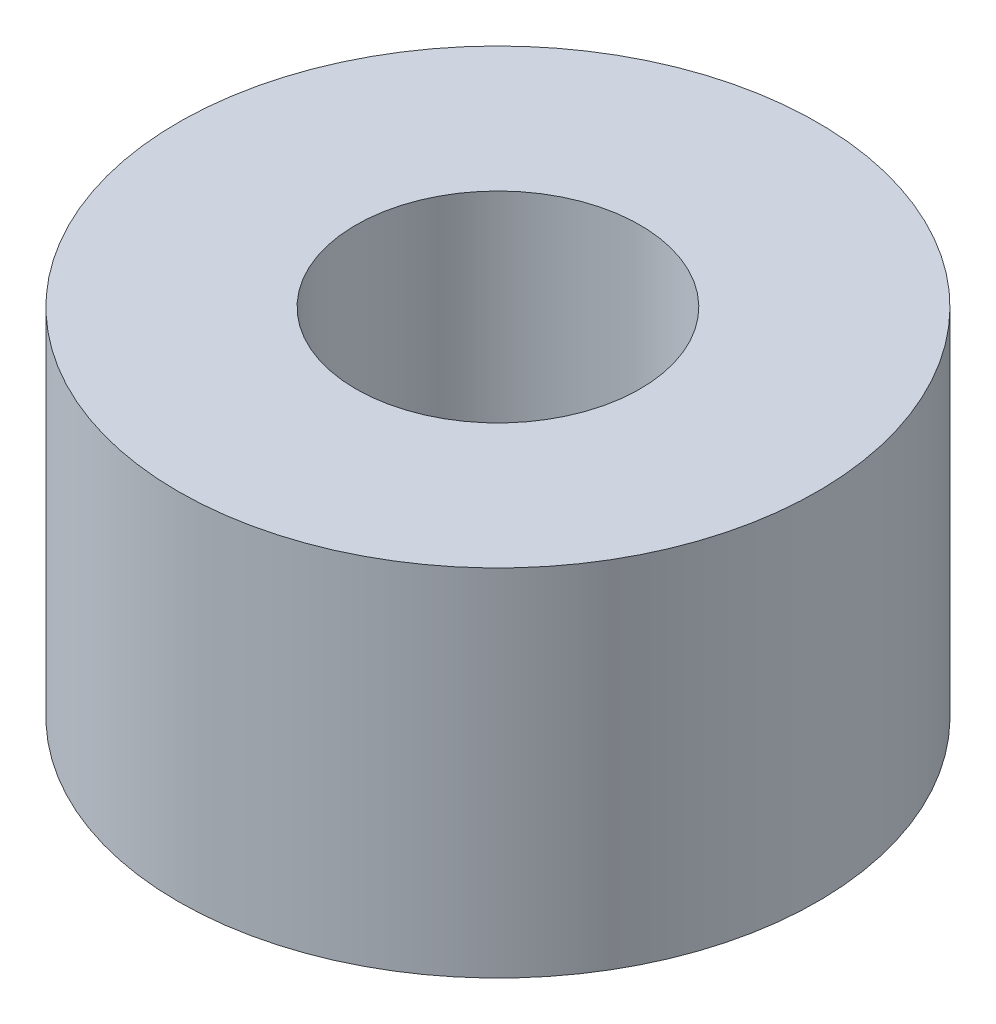
ISO-10303-21;
HEADER;
FILE_DESCRIPTION(('STEP AP214'),'2;1');
FILE_NAME('part.step','',(''),(''),'','','');
FILE_SCHEMA(('AUTOMOTIVE_DESIGN { 1 0 10303 214 1 1 1 1 }'));
ENDSEC;
DATA;
#1=APPLICATION_CONTEXT('core data for automotive mechanical design processes');
#2=APPLICATION_PROTOCOL_DEFINITION('international standard','automotive_design',2000,#1);
#3=PRODUCT_CONTEXT('',#1,'mechanical');
#4=PRODUCT('Part','Part','',(#3));
#5=PRODUCT_RELATED_PRODUCT_CATEGORY('part','',(#4));
#6=PRODUCT_DEFINITION_FORMATION('','',#4);
#7=PRODUCT_DEFINITION_CONTEXT('part definition',#1,'design');
#8=PRODUCT_DEFINITION('design','',#6,#7);
#9=PRODUCT_DEFINITION_SHAPE('','',#8);
#10=(LENGTH_UNIT() NAMED_UNIT(*) SI_UNIT(.MILLI.,.METRE.));
#11=(NAMED_UNIT(*) PLANE_ANGLE_UNIT() SI_UNIT($,.RADIAN.));
#12=(NAMED_UNIT(*) SI_UNIT($,.STERADIAN.) SOLID_ANGLE_UNIT());
#13=UNCERTAINTY_MEASURE_WITH_UNIT(LENGTH_MEASURE(1.E-05),#10,'distance_accuracy_value','');
#14=(GEOMETRIC_REPRESENTATION_CONTEXT(3) GLOBAL_UNCERTAINTY_ASSIGNED_CONTEXT((#13)) GLOBAL_UNIT_ASSIGNED_CONTEXT((#10,
#11,#12)) REPRESENTATION_CONTEXT('',''));
#15=CARTESIAN_POINT('',(0.,0.,0.));
#16=DIRECTION('',(0.,0.,1.));
#17=DIRECTION('',(1.,0.,0.));
#18=AXIS2_PLACEMENT_3D('',#15,#16,#17);
#19=CARTESIAN_POINT('',(0.,2.5,0.));
#20=DIRECTION('',(0.,1.,0.));
#21=DIRECTION('',(0.,0.,1.));
#22=AXIS2_PLACEMENT_3D('',#19,#20,#21);
#23=PLANE('',#22);
#24=CARTESIAN_POINT('',(0.,2.5,0.));
#25=DIRECTION('',(0.,1.,0.));
#26=DIRECTION('',(0.,0.,1.));
#27=AXIS2_PLACEMENT_3D('',#24,#25,#26);
#28=CIRCLE('',#27,2.25);
#29=CARTESIAN_POINT('',(0.,2.5,2.25));
#30=VERTEX_POINT('',#29);
#31=EDGE_CURVE('E10',#30,#30,#28,.T.);
#32=ORIENTED_EDGE('',*,*,#31,.T.);
#33=EDGE_LOOP('',(#32));
#34=FACE_BOUND('',#33,.T.);
#35=CARTESIAN_POINT('',(0.,2.5,0.));
#36=DIRECTION('',(0.,1.,0.));
#37=DIRECTION('',(0.,0.,1.));
#38=AXIS2_PLACEMENT_3D('',#35,#36,#37);
#39=CIRCLE('',#38,1.);
#40=CARTESIAN_POINT('',(0.,2.5,1.));
#41=VERTEX_POINT('',#40);
#42=EDGE_CURVE('E50',#41,#41,#39,.T.);
#43=ORIENTED_EDGE('',*,*,#42,.F.);
#44=EDGE_LOOP('',(#43));
#45=FACE_BOUND('',#44,.T.);
#46=ADVANCED_FACE('F37',(#34,#45),#23,.T.);
#47=CARTESIAN_POINT('',(0.,0.,0.));
#48=DIRECTION('',(0.,1.,0.));
#49=DIRECTION('',(0.,0.,1.));
#50=AXIS2_PLACEMENT_3D('',#47,#48,#49);
#51=PLANE('',#50);
#52=CARTESIAN_POINT('',(0.,0.,0.));
#53=DIRECTION('',(0.,1.,0.));
#54=DIRECTION('',(0.,0.,1.));
#55=AXIS2_PLACEMENT_3D('',#52,#53,#54);
#56=CIRCLE('',#55,2.25);
#57=CARTESIAN_POINT('',(0.,0.,2.25));
#58=VERTEX_POINT('',#57);
#59=EDGE_CURVE('E41',#58,#58,#56,.T.);
#60=ORIENTED_EDGE('',*,*,#59,.F.);
#61=EDGE_LOOP('',(#60));
#62=FACE_BOUND('',#61,.T.);
#63=CARTESIAN_POINT('',(0.,0.,0.));
#64=DIRECTION('',(0.,1.,0.));
#65=DIRECTION('',(0.,0.,1.));
#66=AXIS2_PLACEMENT_3D('',#63,#64,#65);
#67=CIRCLE('',#66,1.);
#68=CARTESIAN_POINT('',(0.,0.,1.));
#69=VERTEX_POINT('',#68);
#70=EDGE_CURVE('E52',#69,#69,#67,.T.);
#71=ORIENTED_EDGE('',*,*,#70,.T.);
#72=EDGE_LOOP('',(#71));
#73=FACE_BOUND('',#72,.T.);
#74=ADVANCED_FACE('F64',(#62,#73),#51,.F.);
#75=CARTESIAN_POINT('',(0.,2.5,0.));
#76=DIRECTION('',(0.,-1.,0.));
#77=DIRECTION('',(0.,0.,-1.));
#78=AXIS2_PLACEMENT_3D('',#75,#76,#77);
#79=CYLINDRICAL_SURFACE('',#78,2.25);
#80=ORIENTED_EDGE('',*,*,#31,.F.);
#81=EDGE_LOOP('',(#80));
#82=FACE_BOUND('',#81,.T.);
#83=ORIENTED_EDGE('',*,*,#59,.T.);
#84=EDGE_LOOP('',(#83));
#85=FACE_BOUND('',#84,.T.);
#86=ADVANCED_FACE('F39',(#82,#85),#79,.T.);
#87=CARTESIAN_POINT('',(0.,2.5,0.));
#88=DIRECTION('',(0.,-1.,0.));
#89=DIRECTION('',(0.,0.,-1.));
#90=AXIS2_PLACEMENT_3D('',#87,#88,#89);
#91=CYLINDRICAL_SURFACE('',#90,1.);
#92=ORIENTED_EDGE('',*,*,#42,.T.);
#93=EDGE_LOOP('',(#92));
#94=FACE_BOUND('',#93,.T.);
#95=ORIENTED_EDGE('',*,*,#70,.F.);
#96=EDGE_LOOP('',(#95));
#97=FACE_BOUND('',#96,.T.);
#98=ADVANCED_FACE('F60',(#94,#97),#91,.F.);
#99=CLOSED_SHELL('',(#46,#74,#86,#98));
#100=MANIFOLD_SOLID_BREP('B2',#99);
#101=ADVANCED_BREP_SHAPE_REPRESENTATION('',(#18,#100),#14);
#102=SHAPE_DEFINITION_REPRESENTATION(#9,#101);
ENDSEC;
END-ISO-10303-21;
